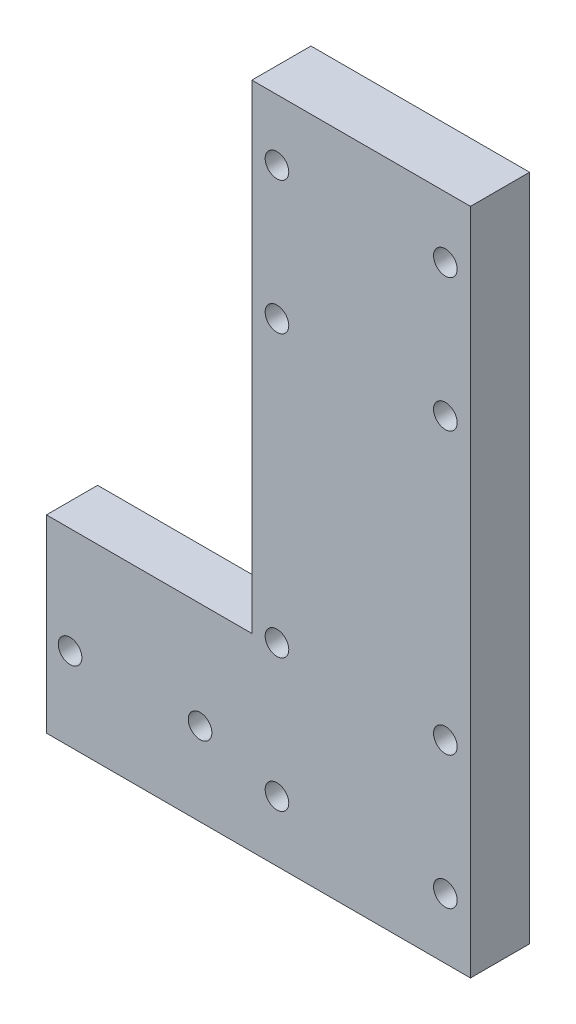
ISO-10303-21;
HEADER;
FILE_DESCRIPTION(('STEP AP214'),'2;1');
FILE_NAME('part.step','',(''),(''),'','','');
FILE_SCHEMA(('AUTOMOTIVE_DESIGN { 1 0 10303 214 1 1 1 1 }'));
ENDSEC;
DATA;
#1=APPLICATION_CONTEXT('core data for automotive mechanical design processes');
#2=APPLICATION_PROTOCOL_DEFINITION('international standard','automotive_design',2000,#1);
#3=PRODUCT_CONTEXT('',#1,'mechanical');
#4=PRODUCT('Part','Part','',(#3));
#5=PRODUCT_RELATED_PRODUCT_CATEGORY('part','',(#4));
#6=PRODUCT_DEFINITION_FORMATION('','',#4);
#7=PRODUCT_DEFINITION_CONTEXT('part definition',#1,'design');
#8=PRODUCT_DEFINITION('design','',#6,#7);
#9=PRODUCT_DEFINITION_SHAPE('','',#8);
#10=(LENGTH_UNIT() NAMED_UNIT(*) SI_UNIT(.MILLI.,.METRE.));
#11=(NAMED_UNIT(*) PLANE_ANGLE_UNIT() SI_UNIT($,.RADIAN.));
#12=(NAMED_UNIT(*) SI_UNIT($,.STERADIAN.) SOLID_ANGLE_UNIT());
#13=UNCERTAINTY_MEASURE_WITH_UNIT(LENGTH_MEASURE(1.E-05),#10,'distance_accuracy_value','');
#14=(GEOMETRIC_REPRESENTATION_CONTEXT(3) GLOBAL_UNCERTAINTY_ASSIGNED_CONTEXT((#13)) GLOBAL_UNIT_ASSIGNED_CONTEXT((#10,
#11,#12)) REPRESENTATION_CONTEXT('',''));
#15=CARTESIAN_POINT('',(0.,0.,0.));
#16=DIRECTION('',(0.,0.,1.));
#17=DIRECTION('',(1.,0.,0.));
#18=AXIS2_PLACEMENT_3D('',#15,#16,#17);
#19=CARTESIAN_POINT('',(-37.1341421835621,6.18838454728551,16.1841344976003));
#20=DIRECTION('',(1.,0.,0.));
#21=DIRECTION('',(0.,1.,0.));
#22=AXIS2_PLACEMENT_3D('',#19,#20,#21);
#23=PLANE('',#22);
#24=DIRECTION('',(0.,-1.,0.));
#25=VECTOR('',#24,1.);
#26=CARTESIAN_POINT('',(-37.134142183562,-220.011615452666,-1.13586550239973));
#27=LINE('',#26,#25);
#28=CARTESIAN_POINT('',(-37.134142183562,-156.011615452666,-1.13586550239973));
#29=VERTEX_POINT('',#28);
#30=CARTESIAN_POINT('',(-37.134142183562,-220.011615452666,-1.13586550239973));
#31=VERTEX_POINT('',#30);
#32=EDGE_CURVE('E125',#29,#31,#27,.T.);
#33=ORIENTED_EDGE('',*,*,#32,.F.);
#34=DIRECTION('',(0.,0.,-1.));
#35=VECTOR('',#34,1.);
#36=CARTESIAN_POINT('',(-37.134142183562,-156.011615452666,16.1841344976003));
#37=LINE('',#36,#35);
#38=CARTESIAN_POINT('',(-37.1341421835621,-156.011615452666,16.1841344976003));
#39=VERTEX_POINT('',#38);
#40=EDGE_CURVE('E63',#39,#29,#37,.T.);
#41=ORIENTED_EDGE('',*,*,#40,.F.);
#42=DIRECTION('',(0.,-1.,0.));
#43=VECTOR('',#42,1.);
#44=CARTESIAN_POINT('',(-37.1341421835621,6.18838454728551,16.1841344976003));
#45=LINE('',#44,#43);
#46=CARTESIAN_POINT('',(-37.1341421835621,6.18838454728551,16.1841344976003));
#47=VERTEX_POINT('',#46);
#48=EDGE_CURVE('E129',#47,#39,#45,.T.);
#49=ORIENTED_EDGE('',*,*,#48,.F.);
#50=DIRECTION('',(0.,0.,-1.));
#51=VECTOR('',#50,1.);
#52=CARTESIAN_POINT('',(-37.1341421835621,6.18838454728551,16.1841344976003));
#53=LINE('',#52,#51);
#54=CARTESIAN_POINT('',(-37.1341421835621,6.18838454728551,-3.81586550239973));
#55=VERTEX_POINT('',#54);
#56=EDGE_CURVE('E55',#47,#55,#53,.T.);
#57=ORIENTED_EDGE('',*,*,#56,.T.);
#58=DIRECTION('',(0.,-1.,0.));
#59=VECTOR('',#58,1.);
#60=CARTESIAN_POINT('',(-37.1341421835621,6.18838454728551,-3.81586550239973));
#61=LINE('',#60,#59);
#62=CARTESIAN_POINT('',(-37.134142183562,-220.011615452666,-3.81586550239973));
#63=VERTEX_POINT('',#62);
#64=EDGE_CURVE('E149',#55,#63,#61,.T.);
#65=ORIENTED_EDGE('',*,*,#64,.T.);
#66=DIRECTION('',(0.,0.,-1.));
#67=VECTOR('',#66,1.);
#68=CARTESIAN_POINT('',(-37.134142183562,-220.011615452666,16.1841344976003));
#69=LINE('',#68,#67);
#70=EDGE_CURVE('E69',#31,#63,#69,.T.);
#71=ORIENTED_EDGE('',*,*,#70,.F.);
#72=EDGE_LOOP('',(#33,#41,#49,#57,#65,#71));
#73=FACE_BOUND('',#72,.T.);
#74=ADVANCED_FACE('F46',(#73),#23,.F.);
#75=CARTESIAN_POINT('',(36.8658578164379,6.18838454728551,16.1841344976003));
#76=DIRECTION('',(-1.,0.,0.));
#77=DIRECTION('',(0.,-1.,0.));
#78=AXIS2_PLACEMENT_3D('',#75,#76,#77);
#79=PLANE('',#78);
#80=DIRECTION('',(0.,1.,0.));
#81=VECTOR('',#80,1.);
#82=CARTESIAN_POINT('',(36.8658578164379,6.18838454728551,-3.81586550239973));
#83=LINE('',#82,#81);
#84=CARTESIAN_POINT('',(36.865857816438,-220.011615452666,-3.81586550239973));
#85=VERTEX_POINT('',#84);
#86=CARTESIAN_POINT('',(36.8658578164379,6.18838454728551,-3.81586550239973));
#87=VERTEX_POINT('',#86);
#88=EDGE_CURVE('E130',#85,#87,#83,.T.);
#89=ORIENTED_EDGE('',*,*,#88,.T.);
#90=DIRECTION('',(0.,0.,-1.));
#91=VECTOR('',#90,1.);
#92=CARTESIAN_POINT('',(36.8658578164379,6.18838454728551,16.1841344976003));
#93=LINE('',#92,#91);
#94=CARTESIAN_POINT('',(36.8658578164379,6.18838454728551,16.1841344976003));
#95=VERTEX_POINT('',#94);
#96=EDGE_CURVE('E13',#95,#87,#93,.T.);
#97=ORIENTED_EDGE('',*,*,#96,.F.);
#98=DIRECTION('',(0.,1.,0.));
#99=VECTOR('',#98,1.);
#100=CARTESIAN_POINT('',(36.8658578164379,6.18838454728551,16.1841344976003));
#101=LINE('',#100,#99);
#102=CARTESIAN_POINT('',(36.865857816438,-220.011615452666,16.1841344976003));
#103=VERTEX_POINT('',#102);
#104=EDGE_CURVE('E139',#103,#95,#101,.T.);
#105=ORIENTED_EDGE('',*,*,#104,.F.);
#106=DIRECTION('',(0.,0.,-1.));
#107=VECTOR('',#106,1.);
#108=CARTESIAN_POINT('',(36.865857816438,-220.011615452666,16.1841344976003));
#109=LINE('',#108,#107);
#110=EDGE_CURVE('E146',#103,#85,#109,.T.);
#111=ORIENTED_EDGE('',*,*,#110,.T.);
#112=EDGE_LOOP('',(#89,#97,#105,#111));
#113=FACE_BOUND('',#112,.T.);
#114=ADVANCED_FACE('F48',(#113),#79,.F.);
#115=CARTESIAN_POINT('',(-37.1341421835621,6.18838454728551,16.1841344976003));
#116=DIRECTION('',(0.,-1.,0.));
#117=DIRECTION('',(0.,0.,-1.));
#118=AXIS2_PLACEMENT_3D('',#115,#116,#117);
#119=PLANE('',#118);
#120=DIRECTION('',(-1.,0.,0.));
#121=VECTOR('',#120,1.);
#122=CARTESIAN_POINT('',(-37.1341421835621,6.18838454728551,-3.81586550239973));
#123=LINE('',#122,#121);
#124=EDGE_CURVE('E133',#87,#55,#123,.T.);
#125=ORIENTED_EDGE('',*,*,#124,.T.);
#126=ORIENTED_EDGE('',*,*,#56,.F.);
#127=DIRECTION('',(-1.,0.,0.));
#128=VECTOR('',#127,1.);
#129=CARTESIAN_POINT('',(-37.1341421835621,6.18838454728551,16.1841344976003));
#130=LINE('',#129,#128);
#131=EDGE_CURVE('E141',#95,#47,#130,.T.);
#132=ORIENTED_EDGE('',*,*,#131,.F.);
#133=ORIENTED_EDGE('',*,*,#96,.T.);
#134=EDGE_LOOP('',(#125,#126,#132,#133));
#135=FACE_BOUND('',#134,.T.);
#136=ADVANCED_FACE('F208',(#135),#119,.F.);
#137=CARTESIAN_POINT('',(-37.134142183562,-220.011615452666,16.1841344976003));
#138=DIRECTION('',(0.,1.,0.));
#139=DIRECTION('',(0.,0.,1.));
#140=AXIS2_PLACEMENT_3D('',#137,#138,#139);
#141=PLANE('',#140);
#142=DIRECTION('',(1.,0.,0.));
#143=VECTOR('',#142,1.);
#144=CARTESIAN_POINT('',(-37.134142183562,-220.011615452666,-3.81586550239973));
#145=LINE('',#144,#143);
#146=EDGE_CURVE('E142',#63,#85,#145,.T.);
#147=ORIENTED_EDGE('',*,*,#146,.T.);
#148=ORIENTED_EDGE('',*,*,#110,.F.);
#149=DIRECTION('',(1.,0.,0.));
#150=VECTOR('',#149,1.);
#151=CARTESIAN_POINT('',(-37.134142183562,-220.011615452666,16.1841344976003));
#152=LINE('',#151,#150);
#153=CARTESIAN_POINT('',(-106.664142183562,-220.011615452666,16.1841344976003));
#154=VERTEX_POINT('',#153);
#155=EDGE_CURVE('E145',#154,#103,#152,.T.);
#156=ORIENTED_EDGE('',*,*,#155,.F.);
#157=DIRECTION('',(0.,0.,1.));
#158=VECTOR('',#157,1.);
#159=CARTESIAN_POINT('',(-106.664142183562,-220.011615452666,16.1841344976003));
#160=LINE('',#159,#158);
#161=CARTESIAN_POINT('',(-106.664142183562,-220.011615452666,-1.13586550239973));
#162=VERTEX_POINT('',#161);
#163=EDGE_CURVE('E123',#162,#154,#160,.T.);
#164=ORIENTED_EDGE('',*,*,#163,.F.);
#165=DIRECTION('',(1.,0.,0.));
#166=VECTOR('',#165,1.);
#167=CARTESIAN_POINT('',(-106.664142183562,-220.011615452666,-1.13586550239973));
#168=LINE('',#167,#166);
#169=EDGE_CURVE('E135',#162,#31,#168,.T.);
#170=ORIENTED_EDGE('',*,*,#169,.T.);
#171=ORIENTED_EDGE('',*,*,#70,.T.);
#172=EDGE_LOOP('',(#147,#148,#156,#164,#170,#171));
#173=FACE_BOUND('',#172,.T.);
#174=ADVANCED_FACE('F200',(#173),#141,.F.);
#175=CARTESIAN_POINT('',(0.,0.,16.1841344976003));
#176=DIRECTION('',(0.,0.,1.));
#177=DIRECTION('',(1.,0.,0.));
#178=AXIS2_PLACEMENT_3D('',#175,#176,#177);
#179=PLANE('',#178);
#180=CARTESIAN_POINT('',(28.3658578164431,-59.5068871305748,16.1841344976003));
#181=DIRECTION('',(0.,0.,1.));
#182=DIRECTION('',(1.,0.,0.));
#183=AXIS2_PLACEMENT_3D('',#180,#181,#182);
#184=CIRCLE('',#183,3.99999999999864);
#185=CARTESIAN_POINT('',(32.3658578164417,-59.5068871305748,16.1841344976003));
#186=VERTEX_POINT('',#185);
#187=EDGE_CURVE('E302',#186,#186,#184,.T.);
#188=ORIENTED_EDGE('',*,*,#187,.F.);
#189=EDGE_LOOP('',(#188));
#190=FACE_BOUND('',#189,.T.);
#191=CARTESIAN_POINT('',(-28.6341421835569,-59.5068871305748,16.1841344976003));
#192=DIRECTION('',(0.,0.,1.));
#193=DIRECTION('',(1.,0.,0.));
#194=AXIS2_PLACEMENT_3D('',#191,#192,#193);
#195=CIRCLE('',#194,3.99999999999864);
#196=CARTESIAN_POINT('',(-24.6341421835583,-59.5068871305748,16.1841344976003));
#197=VERTEX_POINT('',#196);
#198=EDGE_CURVE('E292',#197,#197,#195,.T.);
#199=ORIENTED_EDGE('',*,*,#198,.F.);
#200=EDGE_LOOP('',(#199));
#201=FACE_BOUND('',#200,.T.);
#202=CARTESIAN_POINT('',(-28.6341421835569,-14.5068871305748,16.1841344976003));
#203=DIRECTION('',(0.,0.,1.));
#204=DIRECTION('',(1.,0.,0.));
#205=AXIS2_PLACEMENT_3D('',#202,#203,#204);
#206=CIRCLE('',#205,3.99999999999865);
#207=CARTESIAN_POINT('',(-24.6341421835583,-14.5068871305748,16.1841344976003));
#208=VERTEX_POINT('',#207);
#209=EDGE_CURVE('E287',#208,#208,#206,.T.);
#210=ORIENTED_EDGE('',*,*,#209,.F.);
#211=EDGE_LOOP('',(#210));
#212=FACE_BOUND('',#211,.T.);
#213=CARTESIAN_POINT('',(28.3658578164431,-14.5068871305748,16.1841344976003));
#214=DIRECTION('',(0.,0.,1.));
#215=DIRECTION('',(1.,0.,0.));
#216=AXIS2_PLACEMENT_3D('',#213,#214,#215);
#217=CIRCLE('',#216,3.99999999999864);
#218=CARTESIAN_POINT('',(32.3658578164417,-14.5068871305748,16.1841344976003));
#219=VERTEX_POINT('',#218);
#220=EDGE_CURVE('E168',#219,#219,#217,.T.);
#221=ORIENTED_EDGE('',*,*,#220,.F.);
#222=EDGE_LOOP('',(#221));
#223=FACE_BOUND('',#222,.T.);
#224=CARTESIAN_POINT('',(28.365857817952,-154.506887130526,16.1841344976003));
#225=DIRECTION('',(0.,0.,1.));
#226=DIRECTION('',(1.,0.,0.));
#227=AXIS2_PLACEMENT_3D('',#224,#225,#226);
#228=CIRCLE('',#227,4.00000000000002);
#229=CARTESIAN_POINT('',(32.365857817952,-154.506887130526,16.1841344976003));
#230=VERTEX_POINT('',#229);
#231=EDGE_CURVE('E186',#230,#230,#228,.F.);
#232=ORIENTED_EDGE('',*,*,#231,.T.);
#233=EDGE_LOOP('',(#232));
#234=FACE_BOUND('',#233,.T.);
#235=CARTESIAN_POINT('',(-28.634142182048,-154.506887130526,16.1841344976003));
#236=DIRECTION('',(0.,0.,1.));
#237=DIRECTION('',(1.,0.,0.));
#238=AXIS2_PLACEMENT_3D('',#235,#236,#237);
#239=CIRCLE('',#238,4.);
#240=CARTESIAN_POINT('',(-24.634142182048,-154.506887130526,16.1841344976003));
#241=VERTEX_POINT('',#240);
#242=EDGE_CURVE('E174',#241,#241,#239,.F.);
#243=ORIENTED_EDGE('',*,*,#242,.T.);
#244=EDGE_LOOP('',(#243));
#245=FACE_BOUND('',#244,.T.);
#246=CARTESIAN_POINT('',(-28.634142182048,-199.506887130526,16.1841344976003));
#247=DIRECTION('',(0.,0.,1.));
#248=DIRECTION('',(1.,0.,0.));
#249=AXIS2_PLACEMENT_3D('',#246,#247,#248);
#250=CIRCLE('',#249,4.);
#251=CARTESIAN_POINT('',(-24.634142182048,-199.506887130526,16.1841344976003));
#252=VERTEX_POINT('',#251);
#253=EDGE_CURVE('E171',#252,#252,#250,.F.);
#254=ORIENTED_EDGE('',*,*,#253,.T.);
#255=EDGE_LOOP('',(#254));
#256=FACE_BOUND('',#255,.T.);
#257=CARTESIAN_POINT('',(28.365857817952,-199.506887130526,16.1841344976003));
#258=DIRECTION('',(0.,0.,1.));
#259=DIRECTION('',(1.,0.,0.));
#260=AXIS2_PLACEMENT_3D('',#257,#258,#259);
#261=CIRCLE('',#260,4.00000000000002);
#262=CARTESIAN_POINT('',(32.365857817952,-199.506887130526,16.1841344976003));
#263=VERTEX_POINT('',#262);
#264=EDGE_CURVE('E167',#263,#263,#261,.F.);
#265=ORIENTED_EDGE('',*,*,#264,.T.);
#266=EDGE_LOOP('',(#265));
#267=FACE_BOUND('',#266,.T.);
#268=CARTESIAN_POINT('',(-54.6676777286253,-191.906887130559,16.1841344976003));
#269=DIRECTION('',(0.,0.,1.));
#270=DIRECTION('',(1.,0.,0.));
#271=AXIS2_PLACEMENT_3D('',#268,#269,#270);
#272=CIRCLE('',#271,3.99999999927477);
#273=CARTESIAN_POINT('',(-50.6676777293505,-191.906887130559,16.1841344976003));
#274=VERTEX_POINT('',#273);
#275=EDGE_CURVE('E161',#274,#274,#272,.T.);
#276=ORIENTED_EDGE('',*,*,#275,.F.);
#277=EDGE_LOOP('',(#276));
#278=FACE_BOUND('',#277,.T.);
#279=CARTESIAN_POINT('',(-98.6676777286253,-191.906887130559,16.1841344976003));
#280=DIRECTION('',(0.,0.,1.));
#281=DIRECTION('',(1.,0.,0.));
#282=AXIS2_PLACEMENT_3D('',#279,#280,#281);
#283=CIRCLE('',#282,3.99999999927478);
#284=CARTESIAN_POINT('',(-94.6676777293505,-191.906887130559,16.1841344976003));
#285=VERTEX_POINT('',#284);
#286=EDGE_CURVE('E189',#285,#285,#283,.T.);
#287=ORIENTED_EDGE('',*,*,#286,.F.);
#288=EDGE_LOOP('',(#287));
#289=FACE_BOUND('',#288,.T.);
#290=ORIENTED_EDGE('',*,*,#104,.T.);
#291=ORIENTED_EDGE('',*,*,#131,.T.);
#292=ORIENTED_EDGE('',*,*,#48,.T.);
#293=DIRECTION('',(1.,0.,0.));
#294=VECTOR('',#293,1.);
#295=CARTESIAN_POINT('',(-106.664142183562,-156.011615452666,16.1841344976003));
#296=LINE('',#295,#294);
#297=CARTESIAN_POINT('',(-106.664142183562,-156.011615452666,16.1841344976003));
#298=VERTEX_POINT('',#297);
#299=EDGE_CURVE('E111',#298,#39,#296,.T.);
#300=ORIENTED_EDGE('',*,*,#299,.F.);
#301=DIRECTION('',(0.,1.,0.));
#302=VECTOR('',#301,1.);
#303=CARTESIAN_POINT('',(-106.664142183562,-220.011615452666,16.1841344976003));
#304=LINE('',#303,#302);
#305=EDGE_CURVE('E117',#154,#298,#304,.T.);
#306=ORIENTED_EDGE('',*,*,#305,.F.);
#307=ORIENTED_EDGE('',*,*,#155,.T.);
#308=EDGE_LOOP('',(#290,#291,#292,#300,#306,#307));
#309=FACE_BOUND('',#308,.T.);
#310=ADVANCED_FACE('F128',(#190,#201,#212,#223,#234,#245,#256,#267,#278,#289,#309),#179,.T.);
#311=CARTESIAN_POINT('',(0.,0.,-3.81586550239973));
#312=DIRECTION('',(0.,0.,1.));
#313=DIRECTION('',(1.,0.,0.));
#314=AXIS2_PLACEMENT_3D('',#311,#312,#313);
#315=PLANE('',#314);
#316=CARTESIAN_POINT('',(28.3658578164431,-59.5068871305748,-3.81586550239973));
#317=DIRECTION('',(0.,0.,1.));
#318=DIRECTION('',(1.,0.,0.));
#319=AXIS2_PLACEMENT_3D('',#316,#317,#318);
#320=CIRCLE('',#319,3.99999999999864);
#321=CARTESIAN_POINT('',(32.3658578164417,-59.5068871305748,-3.81586550239973));
#322=VERTEX_POINT('',#321);
#323=EDGE_CURVE('E305',#322,#322,#320,.T.);
#324=ORIENTED_EDGE('',*,*,#323,.T.);
#325=EDGE_LOOP('',(#324));
#326=FACE_BOUND('',#325,.T.);
#327=CARTESIAN_POINT('',(-28.6341421835569,-59.5068871305748,-3.81586550239973));
#328=DIRECTION('',(0.,0.,1.));
#329=DIRECTION('',(1.,0.,0.));
#330=AXIS2_PLACEMENT_3D('',#327,#328,#329);
#331=CIRCLE('',#330,3.99999999999864);
#332=CARTESIAN_POINT('',(-24.6341421835583,-59.5068871305748,-3.81586550239973));
#333=VERTEX_POINT('',#332);
#334=EDGE_CURVE('E297',#333,#333,#331,.T.);
#335=ORIENTED_EDGE('',*,*,#334,.T.);
#336=EDGE_LOOP('',(#335));
#337=FACE_BOUND('',#336,.T.);
#338=CARTESIAN_POINT('',(-28.6341421835569,-14.5068871305748,-3.81586550239973));
#339=DIRECTION('',(0.,0.,1.));
#340=DIRECTION('',(1.,0.,0.));
#341=AXIS2_PLACEMENT_3D('',#338,#339,#340);
#342=CIRCLE('',#341,3.99999999999865);
#343=CARTESIAN_POINT('',(-24.6341421835583,-14.5068871305748,-3.81586550239973));
#344=VERTEX_POINT('',#343);
#345=EDGE_CURVE('E290',#344,#344,#342,.T.);
#346=ORIENTED_EDGE('',*,*,#345,.T.);
#347=EDGE_LOOP('',(#346));
#348=FACE_BOUND('',#347,.T.);
#349=CARTESIAN_POINT('',(28.3658578164431,-14.5068871305748,-3.81586550239973));
#350=DIRECTION('',(0.,0.,1.));
#351=DIRECTION('',(1.,0.,0.));
#352=AXIS2_PLACEMENT_3D('',#349,#350,#351);
#353=CIRCLE('',#352,3.99999999999864);
#354=CARTESIAN_POINT('',(32.3658578164417,-14.5068871305748,-3.81586550239973));
#355=VERTEX_POINT('',#354);
#356=EDGE_CURVE('E294',#355,#355,#353,.T.);
#357=ORIENTED_EDGE('',*,*,#356,.T.);
#358=EDGE_LOOP('',(#357));
#359=FACE_BOUND('',#358,.T.);
#360=CARTESIAN_POINT('',(28.365857817952,-154.506887130526,-3.81586550239973));
#361=DIRECTION('',(0.,0.,1.));
#362=DIRECTION('',(1.,0.,0.));
#363=AXIS2_PLACEMENT_3D('',#360,#361,#362);
#364=CIRCLE('',#363,4.00000000000002);
#365=CARTESIAN_POINT('',(32.365857817952,-154.506887130526,-3.81586550239973));
#366=VERTEX_POINT('',#365);
#367=EDGE_CURVE('E50',#366,#366,#364,.F.);
#368=ORIENTED_EDGE('',*,*,#367,.F.);
#369=EDGE_LOOP('',(#368));
#370=FACE_BOUND('',#369,.T.);
#371=CARTESIAN_POINT('',(-28.634142182048,-154.506887130526,-3.81586550239973));
#372=DIRECTION('',(0.,0.,1.));
#373=DIRECTION('',(1.,0.,0.));
#374=AXIS2_PLACEMENT_3D('',#371,#372,#373);
#375=CIRCLE('',#374,4.);
#376=CARTESIAN_POINT('',(-24.634142182048,-154.506887130526,-3.81586550239973));
#377=VERTEX_POINT('',#376);
#378=EDGE_CURVE('E172',#377,#377,#375,.F.);
#379=ORIENTED_EDGE('',*,*,#378,.F.);
#380=EDGE_LOOP('',(#379));
#381=FACE_BOUND('',#380,.T.);
#382=CARTESIAN_POINT('',(-28.634142182048,-199.506887130526,-3.81586550239973));
#383=DIRECTION('',(0.,0.,1.));
#384=DIRECTION('',(1.,0.,0.));
#385=AXIS2_PLACEMENT_3D('',#382,#383,#384);
#386=CIRCLE('',#385,4.);
#387=CARTESIAN_POINT('',(-24.634142182048,-199.506887130526,-3.81586550239973));
#388=VERTEX_POINT('',#387);
#389=EDGE_CURVE('E169',#388,#388,#386,.F.);
#390=ORIENTED_EDGE('',*,*,#389,.F.);
#391=EDGE_LOOP('',(#390));
#392=FACE_BOUND('',#391,.T.);
#393=CARTESIAN_POINT('',(28.365857817952,-199.506887130526,-3.81586550239973));
#394=DIRECTION('',(0.,0.,1.));
#395=DIRECTION('',(1.,0.,0.));
#396=AXIS2_PLACEMENT_3D('',#393,#394,#395);
#397=CIRCLE('',#396,4.00000000000002);
#398=CARTESIAN_POINT('',(32.365857817952,-199.506887130526,-3.81586550239973));
#399=VERTEX_POINT('',#398);
#400=EDGE_CURVE('E164',#399,#399,#397,.F.);
#401=ORIENTED_EDGE('',*,*,#400,.F.);
#402=EDGE_LOOP('',(#401));
#403=FACE_BOUND('',#402,.T.);
#404=ORIENTED_EDGE('',*,*,#88,.F.);
#405=ORIENTED_EDGE('',*,*,#146,.F.);
#406=ORIENTED_EDGE('',*,*,#64,.F.);
#407=ORIENTED_EDGE('',*,*,#124,.F.);
#408=EDGE_LOOP('',(#404,#405,#406,#407));
#409=FACE_BOUND('',#408,.T.);
#410=ADVANCED_FACE('F223',(#326,#337,#348,#359,#370,#381,#392,#403,#409),#315,.F.);
#411=CARTESIAN_POINT('',(-106.664142183562,-156.011615452666,16.1841344976003));
#412=DIRECTION('',(0.,-1.,0.));
#413=DIRECTION('',(1.,0.,0.));
#414=AXIS2_PLACEMENT_3D('',#411,#412,#413);
#415=PLANE('',#414);
#416=ORIENTED_EDGE('',*,*,#40,.T.);
#417=DIRECTION('',(1.,0.,0.));
#418=VECTOR('',#417,1.);
#419=CARTESIAN_POINT('',(-106.664142183562,-156.011615452666,-1.13586550239973));
#420=LINE('',#419,#418);
#421=CARTESIAN_POINT('',(-106.664142183562,-156.011615452666,-1.13586550239973));
#422=VERTEX_POINT('',#421);
#423=EDGE_CURVE('E113',#422,#29,#420,.T.);
#424=ORIENTED_EDGE('',*,*,#423,.F.);
#425=DIRECTION('',(0.,0.,-1.));
#426=VECTOR('',#425,1.);
#427=CARTESIAN_POINT('',(-106.664142183562,-156.011615452666,16.1841344976003));
#428=LINE('',#427,#426);
#429=EDGE_CURVE('E107',#298,#422,#428,.T.);
#430=ORIENTED_EDGE('',*,*,#429,.F.);
#431=ORIENTED_EDGE('',*,*,#299,.T.);
#432=EDGE_LOOP('',(#416,#424,#430,#431));
#433=FACE_BOUND('',#432,.T.);
#434=ADVANCED_FACE('F109',(#433),#415,.F.);
#435=CARTESIAN_POINT('',(-106.664142183562,-220.011615452666,-1.13586550239973));
#436=DIRECTION('',(0.,0.,1.));
#437=DIRECTION('',(1.,0.,0.));
#438=AXIS2_PLACEMENT_3D('',#435,#436,#437);
#439=PLANE('',#438);
#440=CARTESIAN_POINT('',(-54.6676777286253,-191.906887130559,-1.13586550239973));
#441=DIRECTION('',(0.,0.,1.));
#442=DIRECTION('',(1.,0.,0.));
#443=AXIS2_PLACEMENT_3D('',#440,#441,#442);
#444=CIRCLE('',#443,3.99999999927477);
#445=CARTESIAN_POINT('',(-50.6676777293505,-191.906887130559,-1.13586550239973));
#446=VERTEX_POINT('',#445);
#447=EDGE_CURVE('E160',#446,#446,#444,.T.);
#448=ORIENTED_EDGE('',*,*,#447,.T.);
#449=EDGE_LOOP('',(#448));
#450=FACE_BOUND('',#449,.T.);
#451=CARTESIAN_POINT('',(-98.6676777286253,-191.906887130559,-1.13586550239973));
#452=DIRECTION('',(0.,0.,1.));
#453=DIRECTION('',(1.,0.,0.));
#454=AXIS2_PLACEMENT_3D('',#451,#452,#453);
#455=CIRCLE('',#454,3.99999999927478);
#456=CARTESIAN_POINT('',(-94.6676777293505,-191.906887130559,-1.13586550239973));
#457=VERTEX_POINT('',#456);
#458=EDGE_CURVE('E157',#457,#457,#455,.T.);
#459=ORIENTED_EDGE('',*,*,#458,.T.);
#460=EDGE_LOOP('',(#459));
#461=FACE_BOUND('',#460,.T.);
#462=ORIENTED_EDGE('',*,*,#32,.T.);
#463=ORIENTED_EDGE('',*,*,#169,.F.);
#464=DIRECTION('',(0.,-1.,0.));
#465=VECTOR('',#464,1.);
#466=CARTESIAN_POINT('',(-106.664142183562,-220.011615452666,-1.13586550239973));
#467=LINE('',#466,#465);
#468=EDGE_CURVE('E116',#422,#162,#467,.T.);
#469=ORIENTED_EDGE('',*,*,#468,.F.);
#470=ORIENTED_EDGE('',*,*,#423,.T.);
#471=EDGE_LOOP('',(#462,#463,#469,#470));
#472=FACE_BOUND('',#471,.T.);
#473=ADVANCED_FACE('F202',(#450,#461,#472),#439,.F.);
#474=CARTESIAN_POINT('',(-106.664142183562,0.,0.));
#475=DIRECTION('',(-1.,0.,0.));
#476=DIRECTION('',(0.,-1.,0.));
#477=AXIS2_PLACEMENT_3D('',#474,#475,#476);
#478=PLANE('',#477);
#479=ORIENTED_EDGE('',*,*,#305,.T.);
#480=ORIENTED_EDGE('',*,*,#429,.T.);
#481=ORIENTED_EDGE('',*,*,#468,.T.);
#482=ORIENTED_EDGE('',*,*,#163,.T.);
#483=EDGE_LOOP('',(#479,#480,#481,#482));
#484=FACE_BOUND('',#483,.T.);
#485=ADVANCED_FACE('F121',(#484),#478,.T.);
#486=CARTESIAN_POINT('',(-98.6676777286253,-191.906887130559,-3.81586550239973));
#487=DIRECTION('',(0.,0.,1.));
#488=DIRECTION('',(1.,0.,0.));
#489=AXIS2_PLACEMENT_3D('',#486,#487,#488);
#490=CYLINDRICAL_SURFACE('',#489,3.99999999927478);
#491=ORIENTED_EDGE('',*,*,#286,.T.);
#492=EDGE_LOOP('',(#491));
#493=FACE_BOUND('',#492,.T.);
#494=ORIENTED_EDGE('',*,*,#458,.F.);
#495=EDGE_LOOP('',(#494));
#496=FACE_BOUND('',#495,.T.);
#497=ADVANCED_FACE('F243',(#493,#496),#490,.F.);
#498=CARTESIAN_POINT('',(-54.6676777286253,-191.906887130559,-3.81586550239973));
#499=DIRECTION('',(0.,0.,1.));
#500=DIRECTION('',(1.,0.,0.));
#501=AXIS2_PLACEMENT_3D('',#498,#499,#500);
#502=CYLINDRICAL_SURFACE('',#501,3.99999999927477);
#503=ORIENTED_EDGE('',*,*,#275,.T.);
#504=EDGE_LOOP('',(#503));
#505=FACE_BOUND('',#504,.T.);
#506=ORIENTED_EDGE('',*,*,#447,.F.);
#507=EDGE_LOOP('',(#506));
#508=FACE_BOUND('',#507,.T.);
#509=ADVANCED_FACE('F246',(#505,#508),#502,.F.);
#510=CARTESIAN_POINT('',(28.365857817952,-199.506887130526,16.8841344975935));
#511=DIRECTION('',(0.,0.,-1.));
#512=DIRECTION('',(-1.,0.,0.));
#513=AXIS2_PLACEMENT_3D('',#510,#511,#512);
#514=CYLINDRICAL_SURFACE('',#513,4.00000000000002);
#515=ORIENTED_EDGE('',*,*,#264,.F.);
#516=EDGE_LOOP('',(#515));
#517=FACE_BOUND('',#516,.T.);
#518=ORIENTED_EDGE('',*,*,#400,.T.);
#519=EDGE_LOOP('',(#518));
#520=FACE_BOUND('',#519,.T.);
#521=ADVANCED_FACE('F250',(#517,#520),#514,.F.);
#522=CARTESIAN_POINT('',(-28.634142182048,-199.506887130526,16.8841344975935));
#523=DIRECTION('',(0.,0.,-1.));
#524=DIRECTION('',(-1.,0.,0.));
#525=AXIS2_PLACEMENT_3D('',#522,#523,#524);
#526=CYLINDRICAL_SURFACE('',#525,4.);
#527=ORIENTED_EDGE('',*,*,#253,.F.);
#528=EDGE_LOOP('',(#527));
#529=FACE_BOUND('',#528,.T.);
#530=ORIENTED_EDGE('',*,*,#389,.T.);
#531=EDGE_LOOP('',(#530));
#532=FACE_BOUND('',#531,.T.);
#533=ADVANCED_FACE('F254',(#529,#532),#526,.F.);
#534=CARTESIAN_POINT('',(-28.634142182048,-154.506887130526,16.8841344975935));
#535=DIRECTION('',(0.,0.,-1.));
#536=DIRECTION('',(-1.,0.,0.));
#537=AXIS2_PLACEMENT_3D('',#534,#535,#536);
#538=CYLINDRICAL_SURFACE('',#537,4.);
#539=ORIENTED_EDGE('',*,*,#242,.F.);
#540=EDGE_LOOP('',(#539));
#541=FACE_BOUND('',#540,.T.);
#542=ORIENTED_EDGE('',*,*,#378,.T.);
#543=EDGE_LOOP('',(#542));
#544=FACE_BOUND('',#543,.T.);
#545=ADVANCED_FACE('F260',(#541,#544),#538,.F.);
#546=CARTESIAN_POINT('',(28.365857817952,-154.506887130526,16.8841344975935));
#547=DIRECTION('',(0.,0.,-1.));
#548=DIRECTION('',(-1.,0.,0.));
#549=AXIS2_PLACEMENT_3D('',#546,#547,#548);
#550=CYLINDRICAL_SURFACE('',#549,4.00000000000002);
#551=ORIENTED_EDGE('',*,*,#231,.F.);
#552=EDGE_LOOP('',(#551));
#553=FACE_BOUND('',#552,.T.);
#554=ORIENTED_EDGE('',*,*,#367,.T.);
#555=EDGE_LOOP('',(#554));
#556=FACE_BOUND('',#555,.T.);
#557=ADVANCED_FACE('F256',(#553,#556),#550,.F.);
#558=CARTESIAN_POINT('',(28.3658578164431,-14.5068871305748,16.1841344976003));
#559=DIRECTION('',(0.,0.,-1.));
#560=DIRECTION('',(-1.,0.,0.));
#561=AXIS2_PLACEMENT_3D('',#558,#559,#560);
#562=CYLINDRICAL_SURFACE('',#561,3.99999999999864);
#563=ORIENTED_EDGE('',*,*,#220,.T.);
#564=EDGE_LOOP('',(#563));
#565=FACE_BOUND('',#564,.T.);
#566=ORIENTED_EDGE('',*,*,#356,.F.);
#567=EDGE_LOOP('',(#566));
#568=FACE_BOUND('',#567,.T.);
#569=ADVANCED_FACE('F259',(#565,#568),#562,.F.);
#570=CARTESIAN_POINT('',(-28.6341421835569,-14.5068871305748,16.1841344976003));
#571=DIRECTION('',(0.,0.,-1.));
#572=DIRECTION('',(-1.,0.,0.));
#573=AXIS2_PLACEMENT_3D('',#570,#571,#572);
#574=CYLINDRICAL_SURFACE('',#573,3.99999999999865);
#575=ORIENTED_EDGE('',*,*,#209,.T.);
#576=EDGE_LOOP('',(#575));
#577=FACE_BOUND('',#576,.T.);
#578=ORIENTED_EDGE('',*,*,#345,.F.);
#579=EDGE_LOOP('',(#578));
#580=FACE_BOUND('',#579,.T.);
#581=ADVANCED_FACE('F270',(#577,#580),#574,.F.);
#582=CARTESIAN_POINT('',(-28.6341421835569,-59.5068871305748,16.1841344976003));
#583=DIRECTION('',(0.,0.,-1.));
#584=DIRECTION('',(-1.,0.,0.));
#585=AXIS2_PLACEMENT_3D('',#582,#583,#584);
#586=CYLINDRICAL_SURFACE('',#585,3.99999999999864);
#587=ORIENTED_EDGE('',*,*,#198,.T.);
#588=EDGE_LOOP('',(#587));
#589=FACE_BOUND('',#588,.T.);
#590=ORIENTED_EDGE('',*,*,#334,.F.);
#591=EDGE_LOOP('',(#590));
#592=FACE_BOUND('',#591,.T.);
#593=ADVANCED_FACE('F275',(#589,#592),#586,.F.);
#594=CARTESIAN_POINT('',(28.3658578164431,-59.5068871305748,16.1841344976003));
#595=DIRECTION('',(0.,0.,-1.));
#596=DIRECTION('',(-1.,0.,0.));
#597=AXIS2_PLACEMENT_3D('',#594,#595,#596);
#598=CYLINDRICAL_SURFACE('',#597,3.99999999999864);
#599=ORIENTED_EDGE('',*,*,#187,.T.);
#600=EDGE_LOOP('',(#599));
#601=FACE_BOUND('',#600,.T.);
#602=ORIENTED_EDGE('',*,*,#323,.F.);
#603=EDGE_LOOP('',(#602));
#604=FACE_BOUND('',#603,.T.);
#605=ADVANCED_FACE('F272',(#601,#604),#598,.F.);
#606=CLOSED_SHELL('',(#74,#114,#136,#174,#310,#410,#434,#473,#485,#497,#509,#521,#533,#545,#557,
#569,#581,#593,#605));
#607=MANIFOLD_SOLID_BREP('B2',#606);
#608=ADVANCED_BREP_SHAPE_REPRESENTATION('',(#18,#607),#14);
#609=SHAPE_DEFINITION_REPRESENTATION(#9,#608);
ENDSEC;
END-ISO-10303-21;
